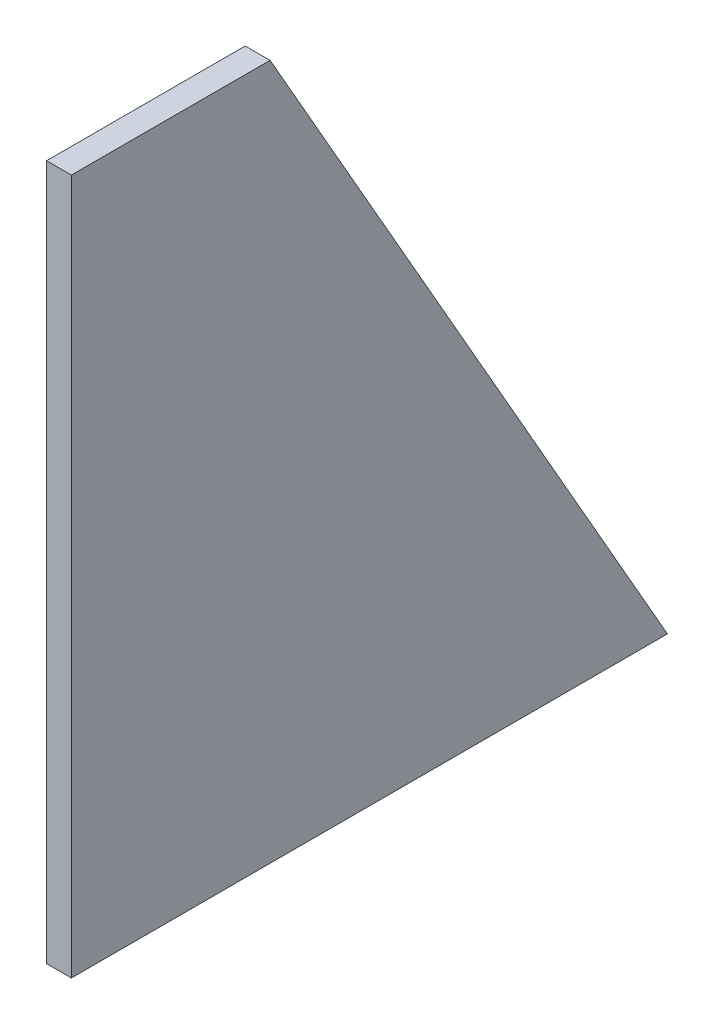
ISO-10303-21;
HEADER;
FILE_DESCRIPTION(('STEP AP214'),'2;1');
FILE_NAME('part.step','',(''),(''),'','','');
FILE_SCHEMA(('AUTOMOTIVE_DESIGN { 1 0 10303 214 1 1 1 1 }'));
ENDSEC;
DATA;
#1=APPLICATION_CONTEXT('core data for automotive mechanical design processes');
#2=APPLICATION_PROTOCOL_DEFINITION('international standard','automotive_design',2000,#1);
#3=PRODUCT_CONTEXT('',#1,'mechanical');
#4=PRODUCT('Part','Part','',(#3));
#5=PRODUCT_RELATED_PRODUCT_CATEGORY('part','',(#4));
#6=PRODUCT_DEFINITION_FORMATION('','',#4);
#7=PRODUCT_DEFINITION_CONTEXT('part definition',#1,'design');
#8=PRODUCT_DEFINITION('design','',#6,#7);
#9=PRODUCT_DEFINITION_SHAPE('','',#8);
#10=(LENGTH_UNIT() NAMED_UNIT(*) SI_UNIT(.MILLI.,.METRE.));
#11=(NAMED_UNIT(*) PLANE_ANGLE_UNIT() SI_UNIT($,.RADIAN.));
#12=(NAMED_UNIT(*) SI_UNIT($,.STERADIAN.) SOLID_ANGLE_UNIT());
#13=UNCERTAINTY_MEASURE_WITH_UNIT(LENGTH_MEASURE(1.E-05),#10,'distance_accuracy_value','');
#14=(GEOMETRIC_REPRESENTATION_CONTEXT(3) GLOBAL_UNCERTAINTY_ASSIGNED_CONTEXT((#13)) GLOBAL_UNIT_ASSIGNED_CONTEXT((#10,
#11,#12)) REPRESENTATION_CONTEXT('',''));
#15=CARTESIAN_POINT('',(0.,0.,0.));
#16=DIRECTION('',(0.,0.,1.));
#17=DIRECTION('',(1.,0.,0.));
#18=AXIS2_PLACEMENT_3D('',#15,#16,#17);
#19=CARTESIAN_POINT('',(6.35,0.,0.));
#20=DIRECTION('',(0.,1.,0.));
#21=DIRECTION('',(0.,0.,1.));
#22=AXIS2_PLACEMENT_3D('',#19,#20,#21);
#23=PLANE('',#22);
#24=DIRECTION('',(0.,0.,-1.));
#25=VECTOR('',#24,1.);
#26=CARTESIAN_POINT('',(0.,0.,0.));
#27=LINE('',#26,#25);
#28=CARTESIAN_POINT('',(0.,0.,0.));
#29=VERTEX_POINT('',#28);
#30=CARTESIAN_POINT('',(0.,0.,-152.4));
#31=VERTEX_POINT('',#30);
#32=EDGE_CURVE('E99',#29,#31,#27,.T.);
#33=ORIENTED_EDGE('',*,*,#32,.T.);
#34=DIRECTION('',(-1.,0.,0.));
#35=VECTOR('',#34,1.);
#36=CARTESIAN_POINT('',(6.35,0.,-152.4));
#37=LINE('',#36,#35);
#38=CARTESIAN_POINT('',(6.35,0.,-152.4));
#39=VERTEX_POINT('',#38);
#40=EDGE_CURVE('E11',#39,#31,#37,.T.);
#41=ORIENTED_EDGE('',*,*,#40,.F.);
#42=DIRECTION('',(0.,0.,-1.));
#43=VECTOR('',#42,1.);
#44=CARTESIAN_POINT('',(6.35,0.,0.));
#45=LINE('',#44,#43);
#46=CARTESIAN_POINT('',(6.35,0.,0.));
#47=VERTEX_POINT('',#46);
#48=EDGE_CURVE('E76',#47,#39,#45,.T.);
#49=ORIENTED_EDGE('',*,*,#48,.F.);
#50=DIRECTION('',(-1.,0.,0.));
#51=VECTOR('',#50,1.);
#52=CARTESIAN_POINT('',(6.35,0.,0.));
#53=LINE('',#52,#51);
#54=EDGE_CURVE('E52',#47,#29,#53,.T.);
#55=ORIENTED_EDGE('',*,*,#54,.T.);
#56=EDGE_LOOP('',(#33,#41,#49,#55));
#57=FACE_BOUND('',#56,.T.);
#58=ADVANCED_FACE('F36',(#57),#23,.F.);
#59=CARTESIAN_POINT('',(6.35,177.8,-50.8));
#60=DIRECTION('',(0.,0.496138938356834,-0.868243142124459));
#61=DIRECTION('',(0.,0.868243142124459,0.496138938356834));
#62=AXIS2_PLACEMENT_3D('',#59,#60,#61);
#63=PLANE('',#62);
#64=DIRECTION('',(0.,-0.868243142124459,-0.496138938356834));
#65=VECTOR('',#64,1.);
#66=CARTESIAN_POINT('',(0.,177.8,-50.8));
#67=LINE('',#66,#65);
#68=CARTESIAN_POINT('',(0.,177.8,-50.8));
#69=VERTEX_POINT('',#68);
#70=EDGE_CURVE('E85',#69,#31,#67,.T.);
#71=ORIENTED_EDGE('',*,*,#70,.F.);
#72=DIRECTION('',(-1.,0.,0.));
#73=VECTOR('',#72,1.);
#74=CARTESIAN_POINT('',(6.35,177.8,-50.8));
#75=LINE('',#74,#73);
#76=CARTESIAN_POINT('',(6.35,177.8,-50.8));
#77=VERTEX_POINT('',#76);
#78=EDGE_CURVE('E44',#77,#69,#75,.T.);
#79=ORIENTED_EDGE('',*,*,#78,.F.);
#80=DIRECTION('',(0.,-0.868243142124459,-0.496138938356834));
#81=VECTOR('',#80,1.);
#82=CARTESIAN_POINT('',(6.35,177.8,-50.8));
#83=LINE('',#82,#81);
#84=EDGE_CURVE('E83',#77,#39,#83,.T.);
#85=ORIENTED_EDGE('',*,*,#84,.T.);
#86=ORIENTED_EDGE('',*,*,#40,.T.);
#87=EDGE_LOOP('',(#71,#79,#85,#86));
#88=FACE_BOUND('',#87,.T.);
#89=ADVANCED_FACE('F82',(#88),#63,.T.);
#90=CARTESIAN_POINT('',(6.35,177.8,0.));
#91=DIRECTION('',(0.,1.,0.));
#92=DIRECTION('',(0.,0.,1.));
#93=AXIS2_PLACEMENT_3D('',#90,#91,#92);
#94=PLANE('',#93);
#95=DIRECTION('',(0.,0.,-1.));
#96=VECTOR('',#95,1.);
#97=CARTESIAN_POINT('',(0.,177.8,0.));
#98=LINE('',#97,#96);
#99=CARTESIAN_POINT('',(0.,177.8,0.));
#100=VERTEX_POINT('',#99);
#101=EDGE_CURVE('E102',#100,#69,#98,.T.);
#102=ORIENTED_EDGE('',*,*,#101,.F.);
#103=DIRECTION('',(-1.,0.,0.));
#104=VECTOR('',#103,1.);
#105=CARTESIAN_POINT('',(6.35,177.8,0.));
#106=LINE('',#105,#104);
#107=CARTESIAN_POINT('',(6.35,177.8,0.));
#108=VERTEX_POINT('',#107);
#109=EDGE_CURVE('E65',#108,#100,#106,.T.);
#110=ORIENTED_EDGE('',*,*,#109,.F.);
#111=DIRECTION('',(0.,0.,-1.));
#112=VECTOR('',#111,1.);
#113=CARTESIAN_POINT('',(6.35,177.8,0.));
#114=LINE('',#113,#112);
#115=EDGE_CURVE('E91',#108,#77,#114,.T.);
#116=ORIENTED_EDGE('',*,*,#115,.T.);
#117=ORIENTED_EDGE('',*,*,#78,.T.);
#118=EDGE_LOOP('',(#102,#110,#116,#117));
#119=FACE_BOUND('',#118,.T.);
#120=ADVANCED_FACE('F93',(#119),#94,.T.);
#121=CARTESIAN_POINT('',(6.35,0.,0.));
#122=DIRECTION('',(0.,0.,1.));
#123=DIRECTION('',(1.,0.,0.));
#124=AXIS2_PLACEMENT_3D('',#121,#122,#123);
#125=PLANE('',#124);
#126=DIRECTION('',(0.,1.,0.));
#127=VECTOR('',#126,1.);
#128=CARTESIAN_POINT('',(0.,0.,0.));
#129=LINE('',#128,#127);
#130=EDGE_CURVE('E104',#29,#100,#129,.T.);
#131=ORIENTED_EDGE('',*,*,#130,.F.);
#132=ORIENTED_EDGE('',*,*,#54,.F.);
#133=DIRECTION('',(0.,1.,0.));
#134=VECTOR('',#133,1.);
#135=CARTESIAN_POINT('',(6.35,0.,0.));
#136=LINE('',#135,#134);
#137=EDGE_CURVE('E94',#47,#108,#136,.T.);
#138=ORIENTED_EDGE('',*,*,#137,.T.);
#139=ORIENTED_EDGE('',*,*,#109,.T.);
#140=EDGE_LOOP('',(#131,#132,#138,#139));
#141=FACE_BOUND('',#140,.T.);
#142=ADVANCED_FACE('F110',(#141),#125,.T.);
#143=CARTESIAN_POINT('',(6.35,0.,0.));
#144=DIRECTION('',(1.,0.,0.));
#145=DIRECTION('',(0.,0.,-1.));
#146=AXIS2_PLACEMENT_3D('',#143,#144,#145);
#147=PLANE('',#146);
#148=ORIENTED_EDGE('',*,*,#48,.T.);
#149=ORIENTED_EDGE('',*,*,#84,.F.);
#150=ORIENTED_EDGE('',*,*,#115,.F.);
#151=ORIENTED_EDGE('',*,*,#137,.F.);
#152=EDGE_LOOP('',(#148,#149,#150,#151));
#153=FACE_BOUND('',#152,.T.);
#154=ADVANCED_FACE('F90',(#153),#147,.T.);
#155=CARTESIAN_POINT('',(0.,0.,0.));
#156=DIRECTION('',(1.,0.,0.));
#157=DIRECTION('',(0.,0.,-1.));
#158=AXIS2_PLACEMENT_3D('',#155,#156,#157);
#159=PLANE('',#158);
#160=ORIENTED_EDGE('',*,*,#32,.F.);
#161=ORIENTED_EDGE('',*,*,#130,.T.);
#162=ORIENTED_EDGE('',*,*,#101,.T.);
#163=ORIENTED_EDGE('',*,*,#70,.T.);
#164=EDGE_LOOP('',(#160,#161,#162,#163));
#165=FACE_BOUND('',#164,.T.);
#166=ADVANCED_FACE('F109',(#165),#159,.F.);
#167=CLOSED_SHELL('',(#58,#89,#120,#142,#154,#166));
#168=MANIFOLD_SOLID_BREP('B2',#167);
#169=ADVANCED_BREP_SHAPE_REPRESENTATION('',(#18,#168),#14);
#170=SHAPE_DEFINITION_REPRESENTATION(#9,#169);
ENDSEC;
END-ISO-10303-21;
